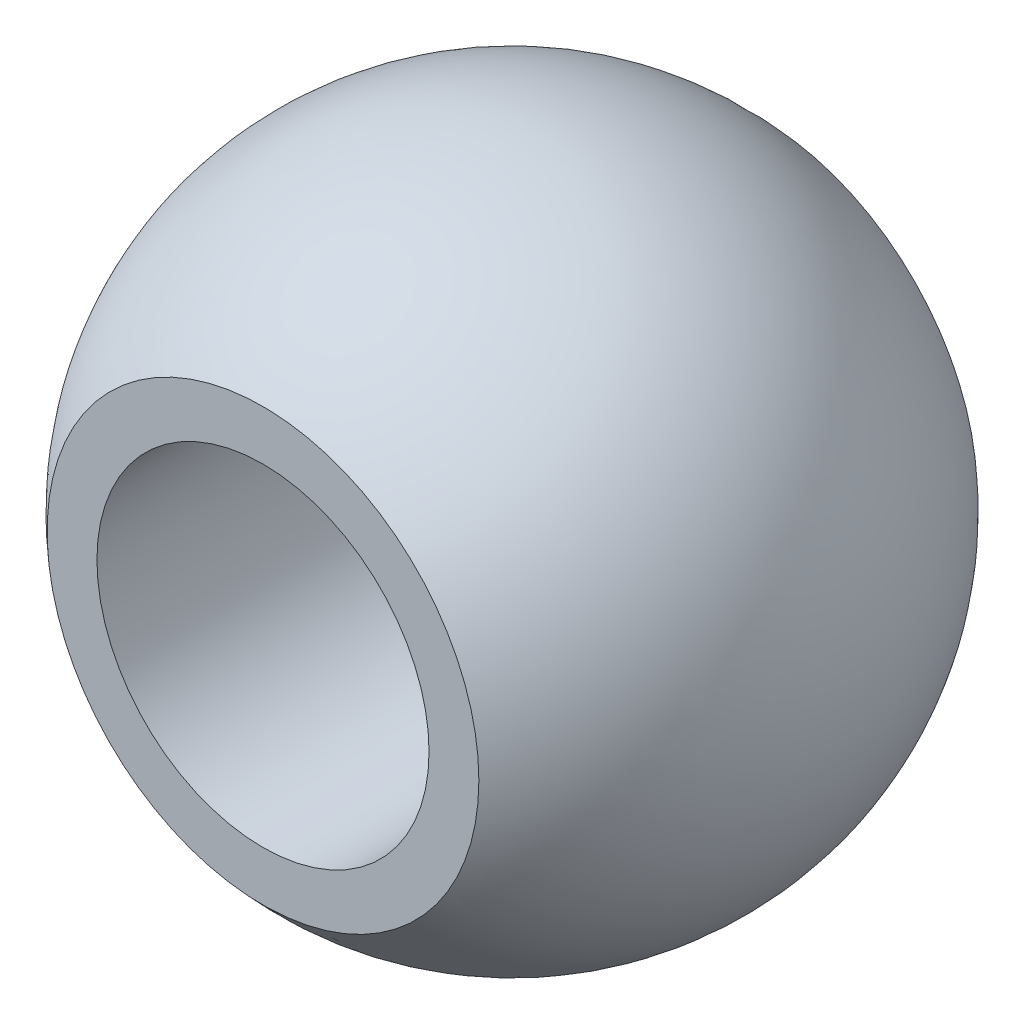
ISO-10303-21;
HEADER;
FILE_DESCRIPTION(('STEP AP214'),'2;1');
FILE_NAME('part.step','',(''),(''),'','','');
FILE_SCHEMA(('AUTOMOTIVE_DESIGN { 1 0 10303 214 1 1 1 1 }'));
ENDSEC;
DATA;
#1=APPLICATION_CONTEXT('core data for automotive mechanical design processes');
#2=APPLICATION_PROTOCOL_DEFINITION('international standard','automotive_design',2000,#1);
#3=PRODUCT_CONTEXT('',#1,'mechanical');
#4=PRODUCT('Part','Part','',(#3));
#5=PRODUCT_RELATED_PRODUCT_CATEGORY('part','',(#4));
#6=PRODUCT_DEFINITION_FORMATION('','',#4);
#7=PRODUCT_DEFINITION_CONTEXT('part definition',#1,'design');
#8=PRODUCT_DEFINITION('design','',#6,#7);
#9=PRODUCT_DEFINITION_SHAPE('','',#8);
#10=(LENGTH_UNIT() NAMED_UNIT(*) SI_UNIT(.MILLI.,.METRE.));
#11=(NAMED_UNIT(*) PLANE_ANGLE_UNIT() SI_UNIT($,.RADIAN.));
#12=(NAMED_UNIT(*) SI_UNIT($,.STERADIAN.) SOLID_ANGLE_UNIT());
#13=UNCERTAINTY_MEASURE_WITH_UNIT(LENGTH_MEASURE(1.E-05),#10,'distance_accuracy_value','');
#14=(GEOMETRIC_REPRESENTATION_CONTEXT(3) GLOBAL_UNCERTAINTY_ASSIGNED_CONTEXT((#13)) GLOBAL_UNIT_ASSIGNED_CONTEXT((#10,
#11,#12)) REPRESENTATION_CONTEXT('',''));
#15=CARTESIAN_POINT('',(0.,0.,0.));
#16=DIRECTION('',(0.,0.,1.));
#17=DIRECTION('',(1.,0.,0.));
#18=AXIS2_PLACEMENT_3D('',#15,#16,#17);
#19=CARTESIAN_POINT('',(54.,12.,6.));
#20=DIRECTION('',(0.,0.,1.));
#21=DIRECTION('',(1.,0.,0.));
#22=AXIS2_PLACEMENT_3D('',#19,#20,#21);
#23=PLANE('',#22);
#24=CARTESIAN_POINT('',(42.,0.,6.));
#25=DIRECTION('',(0.,0.,1.));
#26=DIRECTION('',(1.,0.,0.));
#27=AXIS2_PLACEMENT_3D('',#24,#25,#26);
#28=CIRCLE('',#27,4.);
#29=CARTESIAN_POINT('',(46.,0.,6.));
#30=VERTEX_POINT('',#29);
#31=EDGE_CURVE('E52',#30,#30,#28,.T.);
#32=ORIENTED_EDGE('',*,*,#31,.F.);
#33=EDGE_LOOP('',(#32));
#34=FACE_BOUND('',#33,.T.);
#35=CARTESIAN_POINT('',(42.,0.,6.));
#36=DIRECTION('',(0.,0.,-1.));
#37=DIRECTION('',(1.,0.,0.));
#38=AXIS2_PLACEMENT_3D('',#35,#36,#37);
#39=CIRCLE('',#38,5.2);
#40=CARTESIAN_POINT('',(47.2,0.,6.));
#41=VERTEX_POINT('',#40);
#42=EDGE_CURVE('E11',#41,#41,#39,.T.);
#43=ORIENTED_EDGE('',*,*,#42,.F.);
#44=EDGE_LOOP('',(#43));
#45=FACE_BOUND('',#44,.T.);
#46=ADVANCED_FACE('F16',(#34,#45),#23,.T.);
#47=CARTESIAN_POINT('',(42.,0.,0.));
#48=DIRECTION('',(1.,0.,0.));
#49=DIRECTION('',(0.,-1.,0.));
#50=AXIS2_PLACEMENT_3D('',#47,#48,#49);
#51=SPHERICAL_SURFACE('',#50,7.93977329651169);
#52=CARTESIAN_POINT('',(42.,0.,-6.));
#53=DIRECTION('',(0.,0.,1.));
#54=DIRECTION('',(-1.,0.,0.));
#55=AXIS2_PLACEMENT_3D('',#52,#53,#54);
#56=CIRCLE('',#55,5.2);
#57=CARTESIAN_POINT('',(36.8,0.,-6.));
#58=VERTEX_POINT('',#57);
#59=EDGE_CURVE('E25',#58,#58,#56,.T.);
#60=ORIENTED_EDGE('',*,*,#59,.T.);
#61=EDGE_LOOP('',(#60));
#62=FACE_BOUND('',#61,.T.);
#63=ORIENTED_EDGE('',*,*,#42,.T.);
#64=EDGE_LOOP('',(#63));
#65=FACE_BOUND('',#64,.T.);
#66=CARTESIAN_POINT('',(34.0602267034883,0.,0.));
#67=VERTEX_POINT('',#66);
#68=VERTEX_LOOP('',#67);
#69=FACE_BOUND('',#68,.T.);
#70=CARTESIAN_POINT('',(49.9397732965117,0.,0.));
#71=VERTEX_POINT('',#70);
#72=VERTEX_LOOP('',#71);
#73=FACE_BOUND('',#72,.T.);
#74=ADVANCED_FACE('F74',(#62,#65,#69,#73),#51,.T.);
#75=CARTESIAN_POINT('',(0.,12.,-6.));
#76=DIRECTION('',(0.,0.,-1.));
#77=DIRECTION('',(0.,-1.,0.));
#78=AXIS2_PLACEMENT_3D('',#75,#76,#77);
#79=PLANE('',#78);
#80=CARTESIAN_POINT('',(42.,0.,-6.));
#81=DIRECTION('',(0.,0.,1.));
#82=DIRECTION('',(1.,0.,0.));
#83=AXIS2_PLACEMENT_3D('',#80,#81,#82);
#84=CIRCLE('',#83,4.);
#85=CARTESIAN_POINT('',(46.,0.,-6.));
#86=VERTEX_POINT('',#85);
#87=EDGE_CURVE('E57',#86,#86,#84,.T.);
#88=ORIENTED_EDGE('',*,*,#87,.T.);
#89=EDGE_LOOP('',(#88));
#90=FACE_BOUND('',#89,.T.);
#91=ORIENTED_EDGE('',*,*,#59,.F.);
#92=EDGE_LOOP('',(#91));
#93=FACE_BOUND('',#92,.T.);
#94=ADVANCED_FACE('F66',(#90,#93),#79,.T.);
#95=CARTESIAN_POINT('',(42.,0.,6.));
#96=DIRECTION('',(0.,0.,1.));
#97=DIRECTION('',(-1.,0.,0.));
#98=AXIS2_PLACEMENT_3D('',#95,#96,#97);
#99=CYLINDRICAL_SURFACE('',#98,4.);
#100=ORIENTED_EDGE('',*,*,#31,.T.);
#101=EDGE_LOOP('',(#100));
#102=FACE_BOUND('',#101,.T.);
#103=ORIENTED_EDGE('',*,*,#87,.F.);
#104=EDGE_LOOP('',(#103));
#105=FACE_BOUND('',#104,.T.);
#106=ADVANCED_FACE('F53',(#102,#105),#99,.F.);
#107=CLOSED_SHELL('',(#46,#74,#94,#106));
#108=MANIFOLD_SOLID_BREP('B1',#107);
#109=ADVANCED_BREP_SHAPE_REPRESENTATION('',(#18,#108),#14);
#110=SHAPE_DEFINITION_REPRESENTATION(#9,#109);
ENDSEC;
END-ISO-10303-21;
